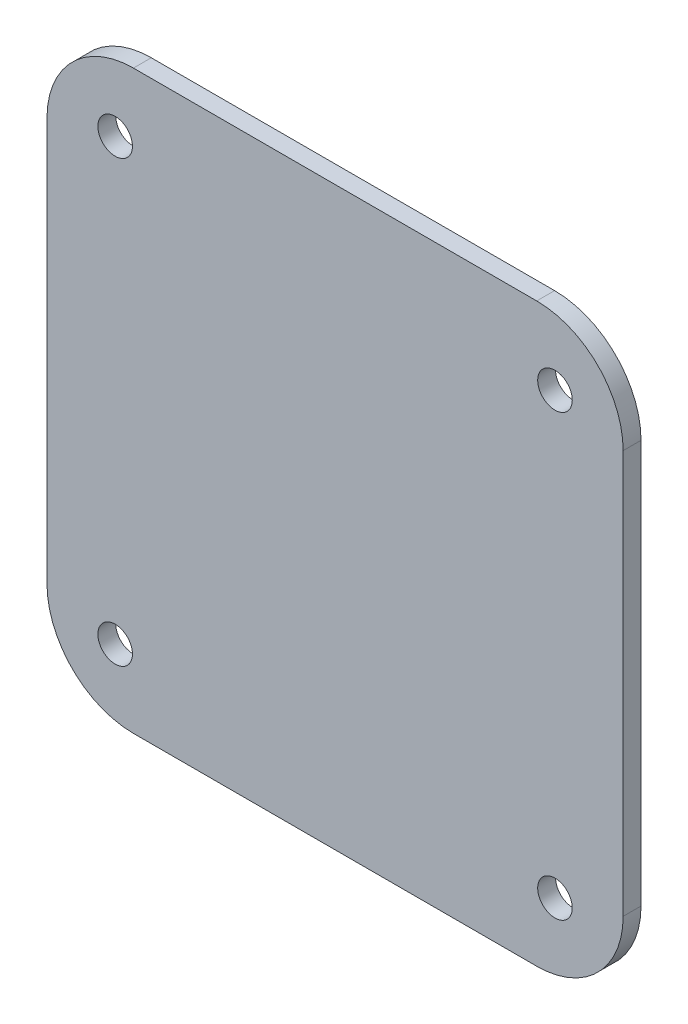
ISO-10303-21;
HEADER;
FILE_DESCRIPTION(('STEP AP214'),'2;1');
FILE_NAME('part.step','',(''),(''),'','','');
FILE_SCHEMA(('AUTOMOTIVE_DESIGN { 1 0 10303 214 1 1 1 1 }'));
ENDSEC;
DATA;
#1=APPLICATION_CONTEXT('core data for automotive mechanical design processes');
#2=APPLICATION_PROTOCOL_DEFINITION('international standard','automotive_design',2000,#1);
#3=PRODUCT_CONTEXT('',#1,'mechanical');
#4=PRODUCT('Part','Part','',(#3));
#5=PRODUCT_RELATED_PRODUCT_CATEGORY('part','',(#4));
#6=PRODUCT_DEFINITION_FORMATION('','',#4);
#7=PRODUCT_DEFINITION_CONTEXT('part definition',#1,'design');
#8=PRODUCT_DEFINITION('design','',#6,#7);
#9=PRODUCT_DEFINITION_SHAPE('','',#8);
#10=(LENGTH_UNIT() NAMED_UNIT(*) SI_UNIT(.MILLI.,.METRE.));
#11=(NAMED_UNIT(*) PLANE_ANGLE_UNIT() SI_UNIT($,.RADIAN.));
#12=(NAMED_UNIT(*) SI_UNIT($,.STERADIAN.) SOLID_ANGLE_UNIT());
#13=UNCERTAINTY_MEASURE_WITH_UNIT(LENGTH_MEASURE(1.E-05),#10,'distance_accuracy_value','');
#14=(GEOMETRIC_REPRESENTATION_CONTEXT(3) GLOBAL_UNCERTAINTY_ASSIGNED_CONTEXT((#13)) GLOBAL_UNIT_ASSIGNED_CONTEXT((#10,
#11,#12)) REPRESENTATION_CONTEXT('',''));
#15=CARTESIAN_POINT('',(0.,0.,0.));
#16=DIRECTION('',(0.,0.,1.));
#17=DIRECTION('',(1.,0.,0.));
#18=AXIS2_PLACEMENT_3D('',#15,#16,#17);
#19=CARTESIAN_POINT('',(0.,0.,3.1));
#20=DIRECTION('',(0.,0.,-1.));
#21=DIRECTION('',(-1.,0.,0.));
#22=AXIS2_PLACEMENT_3D('',#19,#20,#21);
#23=PLANE('',#22);
#24=CARTESIAN_POINT('',(38.1660885145439,-38.1660885145439,3.1));
#25=DIRECTION('',(0.,0.,1.));
#26=DIRECTION('',(1.,0.,0.));
#27=AXIS2_PLACEMENT_3D('',#24,#25,#26);
#28=CIRCLE('',#27,2.99999999999999);
#29=CARTESIAN_POINT('',(41.1660885145439,-38.1660885145439,3.1));
#30=VERTEX_POINT('',#29);
#31=EDGE_CURVE('E187',#30,#30,#28,.T.);
#32=ORIENTED_EDGE('',*,*,#31,.F.);
#33=EDGE_LOOP('',(#32));
#34=FACE_BOUND('',#33,.T.);
#35=CARTESIAN_POINT('',(-38.1660885145439,38.1660885145439,3.1));
#36=DIRECTION('',(0.,0.,1.));
#37=DIRECTION('',(1.,0.,0.));
#38=AXIS2_PLACEMENT_3D('',#35,#36,#37);
#39=CIRCLE('',#38,2.99999999999999);
#40=CARTESIAN_POINT('',(-35.1660885145439,38.1660885145439,3.1));
#41=VERTEX_POINT('',#40);
#42=EDGE_CURVE('E173',#41,#41,#39,.T.);
#43=ORIENTED_EDGE('',*,*,#42,.F.);
#44=EDGE_LOOP('',(#43));
#45=FACE_BOUND('',#44,.T.);
#46=DIRECTION('',(-1.,0.,0.));
#47=VECTOR('',#46,1.);
#48=CARTESIAN_POINT('',(-50.,50.,3.1));
#49=LINE('',#48,#47);
#50=CARTESIAN_POINT('',(35.,50.,3.1));
#51=VERTEX_POINT('',#50);
#52=CARTESIAN_POINT('',(-35.,50.,3.1));
#53=VERTEX_POINT('',#52);
#54=EDGE_CURVE('E168',#51,#53,#49,.T.);
#55=ORIENTED_EDGE('',*,*,#54,.T.);
#56=CARTESIAN_POINT('',(-35.,35.,3.1));
#57=DIRECTION('',(0.,0.,-1.));
#58=DIRECTION('',(-1.,0.,0.));
#59=AXIS2_PLACEMENT_3D('',#56,#57,#58);
#60=CIRCLE('',#59,15.);
#61=CARTESIAN_POINT('',(-50.,35.,3.1));
#62=VERTEX_POINT('',#61);
#63=EDGE_CURVE('E149',#53,#62,#60,.F.);
#64=ORIENTED_EDGE('',*,*,#63,.T.);
#65=DIRECTION('',(0.,-1.,0.));
#66=VECTOR('',#65,1.);
#67=CARTESIAN_POINT('',(-50.,-50.,3.1));
#68=LINE('',#67,#66);
#69=CARTESIAN_POINT('',(-50.,-35.,3.1));
#70=VERTEX_POINT('',#69);
#71=EDGE_CURVE('E119',#62,#70,#68,.T.);
#72=ORIENTED_EDGE('',*,*,#71,.T.);
#73=CARTESIAN_POINT('',(-35.,-35.,3.1));
#74=DIRECTION('',(0.,0.,-1.));
#75=DIRECTION('',(-1.,0.,0.));
#76=AXIS2_PLACEMENT_3D('',#73,#74,#75);
#77=CIRCLE('',#76,15.);
#78=CARTESIAN_POINT('',(-35.,-50.,3.1));
#79=VERTEX_POINT('',#78);
#80=EDGE_CURVE('E55',#70,#79,#77,.F.);
#81=ORIENTED_EDGE('',*,*,#80,.T.);
#82=DIRECTION('',(1.,0.,0.));
#83=VECTOR('',#82,1.);
#84=CARTESIAN_POINT('',(-50.,-50.,3.1));
#85=LINE('',#84,#83);
#86=CARTESIAN_POINT('',(35.,-50.,3.1));
#87=VERTEX_POINT('',#86);
#88=EDGE_CURVE('E135',#79,#87,#85,.T.);
#89=ORIENTED_EDGE('',*,*,#88,.T.);
#90=CARTESIAN_POINT('',(35.,-35.,3.1));
#91=DIRECTION('',(0.,0.,-1.));
#92=DIRECTION('',(-1.,0.,0.));
#93=AXIS2_PLACEMENT_3D('',#90,#91,#92);
#94=CIRCLE('',#93,15.);
#95=CARTESIAN_POINT('',(50.,-35.,3.1));
#96=VERTEX_POINT('',#95);
#97=EDGE_CURVE('E146',#87,#96,#94,.F.);
#98=ORIENTED_EDGE('',*,*,#97,.T.);
#99=DIRECTION('',(0.,1.,0.));
#100=VECTOR('',#99,1.);
#101=CARTESIAN_POINT('',(50.,-50.,3.1));
#102=LINE('',#101,#100);
#103=CARTESIAN_POINT('',(50.,35.,3.1));
#104=VERTEX_POINT('',#103);
#105=EDGE_CURVE('E129',#96,#104,#102,.T.);
#106=ORIENTED_EDGE('',*,*,#105,.T.);
#107=CARTESIAN_POINT('',(35.,35.,3.1));
#108=DIRECTION('',(0.,0.,-1.));
#109=DIRECTION('',(-1.,0.,0.));
#110=AXIS2_PLACEMENT_3D('',#107,#108,#109);
#111=CIRCLE('',#110,15.);
#112=EDGE_CURVE('E144',#104,#51,#111,.F.);
#113=ORIENTED_EDGE('',*,*,#112,.T.);
#114=EDGE_LOOP('',(#55,#64,#72,#81,#89,#98,#106,#113));
#115=FACE_BOUND('',#114,.T.);
#116=CARTESIAN_POINT('',(38.1660885145439,38.1660885145439,3.1));
#117=DIRECTION('',(0.,0.,1.));
#118=DIRECTION('',(1.,0.,0.));
#119=AXIS2_PLACEMENT_3D('',#116,#117,#118);
#120=CIRCLE('',#119,2.99999999999999);
#121=CARTESIAN_POINT('',(41.1660885145439,38.1660885145439,3.1));
#122=VERTEX_POINT('',#121);
#123=EDGE_CURVE('E182',#122,#122,#120,.T.);
#124=ORIENTED_EDGE('',*,*,#123,.F.);
#125=EDGE_LOOP('',(#124));
#126=FACE_BOUND('',#125,.T.);
#127=CARTESIAN_POINT('',(-38.1660885145439,-38.1660885145439,3.1));
#128=DIRECTION('',(0.,0.,1.));
#129=DIRECTION('',(1.,0.,0.));
#130=AXIS2_PLACEMENT_3D('',#127,#128,#129);
#131=CIRCLE('',#130,2.99999999999999);
#132=CARTESIAN_POINT('',(-35.1660885145439,-38.1660885145439,3.1));
#133=VERTEX_POINT('',#132);
#134=EDGE_CURVE('E193',#133,#133,#131,.T.);
#135=ORIENTED_EDGE('',*,*,#134,.F.);
#136=EDGE_LOOP('',(#135));
#137=FACE_BOUND('',#136,.T.);
#138=ADVANCED_FACE('F33',(#34,#45,#115,#126,#137),#23,.F.);
#139=CARTESIAN_POINT('',(0.,0.,0.));
#140=DIRECTION('',(0.,0.,-1.));
#141=DIRECTION('',(-1.,0.,0.));
#142=AXIS2_PLACEMENT_3D('',#139,#140,#141);
#143=PLANE('',#142);
#144=CARTESIAN_POINT('',(38.1660885145439,-38.1660885145439,0.));
#145=DIRECTION('',(0.,0.,1.));
#146=DIRECTION('',(1.,0.,0.));
#147=AXIS2_PLACEMENT_3D('',#144,#145,#146);
#148=CIRCLE('',#147,2.99999999999999);
#149=CARTESIAN_POINT('',(41.1660885145439,-38.1660885145439,0.));
#150=VERTEX_POINT('',#149);
#151=EDGE_CURVE('E190',#150,#150,#148,.T.);
#152=ORIENTED_EDGE('',*,*,#151,.T.);
#153=EDGE_LOOP('',(#152));
#154=FACE_BOUND('',#153,.T.);
#155=CARTESIAN_POINT('',(-38.1660885145439,38.1660885145439,0.));
#156=DIRECTION('',(0.,0.,1.));
#157=DIRECTION('',(1.,0.,0.));
#158=AXIS2_PLACEMENT_3D('',#155,#156,#157);
#159=CIRCLE('',#158,2.99999999999999);
#160=CARTESIAN_POINT('',(-35.1660885145439,38.1660885145439,0.));
#161=VERTEX_POINT('',#160);
#162=EDGE_CURVE('E175',#161,#161,#159,.T.);
#163=ORIENTED_EDGE('',*,*,#162,.T.);
#164=EDGE_LOOP('',(#163));
#165=FACE_BOUND('',#164,.T.);
#166=DIRECTION('',(0.,-1.,0.));
#167=VECTOR('',#166,1.);
#168=CARTESIAN_POINT('',(-50.,-50.,0.));
#169=LINE('',#168,#167);
#170=CARTESIAN_POINT('',(-50.,35.,0.));
#171=VERTEX_POINT('',#170);
#172=CARTESIAN_POINT('',(-50.,-35.,0.));
#173=VERTEX_POINT('',#172);
#174=EDGE_CURVE('E117',#171,#173,#169,.T.);
#175=ORIENTED_EDGE('',*,*,#174,.F.);
#176=CARTESIAN_POINT('',(-35.,35.,0.));
#177=DIRECTION('',(0.,0.,-1.));
#178=DIRECTION('',(-1.,0.,0.));
#179=AXIS2_PLACEMENT_3D('',#176,#177,#178);
#180=CIRCLE('',#179,15.);
#181=CARTESIAN_POINT('',(-35.,50.,0.));
#182=VERTEX_POINT('',#181);
#183=EDGE_CURVE('E100',#171,#182,#180,.T.);
#184=ORIENTED_EDGE('',*,*,#183,.T.);
#185=DIRECTION('',(-1.,0.,0.));
#186=VECTOR('',#185,1.);
#187=CARTESIAN_POINT('',(-50.,50.,0.));
#188=LINE('',#187,#186);
#189=CARTESIAN_POINT('',(35.,50.,0.));
#190=VERTEX_POINT('',#189);
#191=EDGE_CURVE('E127',#190,#182,#188,.T.);
#192=ORIENTED_EDGE('',*,*,#191,.F.);
#193=CARTESIAN_POINT('',(35.,35.,0.));
#194=DIRECTION('',(0.,0.,-1.));
#195=DIRECTION('',(-1.,0.,0.));
#196=AXIS2_PLACEMENT_3D('',#193,#194,#195);
#197=CIRCLE('',#196,15.);
#198=CARTESIAN_POINT('',(50.,35.,0.));
#199=VERTEX_POINT('',#198);
#200=EDGE_CURVE('E120',#190,#199,#197,.T.);
#201=ORIENTED_EDGE('',*,*,#200,.T.);
#202=DIRECTION('',(0.,1.,0.));
#203=VECTOR('',#202,1.);
#204=CARTESIAN_POINT('',(50.,-50.,0.));
#205=LINE('',#204,#203);
#206=CARTESIAN_POINT('',(50.,-35.,0.));
#207=VERTEX_POINT('',#206);
#208=EDGE_CURVE('E131',#207,#199,#205,.T.);
#209=ORIENTED_EDGE('',*,*,#208,.F.);
#210=CARTESIAN_POINT('',(35.,-35.,0.));
#211=DIRECTION('',(0.,0.,-1.));
#212=DIRECTION('',(-1.,0.,0.));
#213=AXIS2_PLACEMENT_3D('',#210,#211,#212);
#214=CIRCLE('',#213,15.);
#215=CARTESIAN_POINT('',(35.,-50.,0.));
#216=VERTEX_POINT('',#215);
#217=EDGE_CURVE('E138',#207,#216,#214,.T.);
#218=ORIENTED_EDGE('',*,*,#217,.T.);
#219=DIRECTION('',(1.,0.,0.));
#220=VECTOR('',#219,1.);
#221=CARTESIAN_POINT('',(-50.,-50.,0.));
#222=LINE('',#221,#220);
#223=CARTESIAN_POINT('',(-35.,-50.,0.));
#224=VERTEX_POINT('',#223);
#225=EDGE_CURVE('E126',#224,#216,#222,.T.);
#226=ORIENTED_EDGE('',*,*,#225,.F.);
#227=CARTESIAN_POINT('',(-35.,-35.,0.));
#228=DIRECTION('',(0.,0.,-1.));
#229=DIRECTION('',(-1.,0.,0.));
#230=AXIS2_PLACEMENT_3D('',#227,#228,#229);
#231=CIRCLE('',#230,15.);
#232=EDGE_CURVE('E111',#224,#173,#231,.T.);
#233=ORIENTED_EDGE('',*,*,#232,.T.);
#234=EDGE_LOOP('',(#175,#184,#192,#201,#209,#218,#226,#233));
#235=FACE_BOUND('',#234,.T.);
#236=CARTESIAN_POINT('',(38.1660885145439,38.1660885145439,0.));
#237=DIRECTION('',(0.,0.,1.));
#238=DIRECTION('',(1.,0.,0.));
#239=AXIS2_PLACEMENT_3D('',#236,#237,#238);
#240=CIRCLE('',#239,2.99999999999999);
#241=CARTESIAN_POINT('',(41.1660885145439,38.1660885145439,0.));
#242=VERTEX_POINT('',#241);
#243=EDGE_CURVE('E184',#242,#242,#240,.T.);
#244=ORIENTED_EDGE('',*,*,#243,.T.);
#245=EDGE_LOOP('',(#244));
#246=FACE_BOUND('',#245,.T.);
#247=CARTESIAN_POINT('',(-38.1660885145439,-38.1660885145439,0.));
#248=DIRECTION('',(0.,0.,1.));
#249=DIRECTION('',(1.,0.,0.));
#250=AXIS2_PLACEMENT_3D('',#247,#248,#249);
#251=CIRCLE('',#250,2.99999999999999);
#252=CARTESIAN_POINT('',(-35.1660885145439,-38.1660885145439,0.));
#253=VERTEX_POINT('',#252);
#254=EDGE_CURVE('E196',#253,#253,#251,.T.);
#255=ORIENTED_EDGE('',*,*,#254,.T.);
#256=EDGE_LOOP('',(#255));
#257=FACE_BOUND('',#256,.T.);
#258=ADVANCED_FACE('F123',(#154,#165,#235,#246,#257),#143,.T.);
#259=CARTESIAN_POINT('',(50.,-50.,3.1));
#260=DIRECTION('',(-1.,0.,0.));
#261=DIRECTION('',(0.,0.,1.));
#262=AXIS2_PLACEMENT_3D('',#259,#260,#261);
#263=PLANE('',#262);
#264=ORIENTED_EDGE('',*,*,#105,.F.);
#265=DIRECTION('',(0.,0.,-1.));
#266=VECTOR('',#265,1.);
#267=CARTESIAN_POINT('',(50.,-35.,3.1));
#268=LINE('',#267,#266);
#269=EDGE_CURVE('E11',#96,#207,#268,.T.);
#270=ORIENTED_EDGE('',*,*,#269,.T.);
#271=ORIENTED_EDGE('',*,*,#208,.T.);
#272=DIRECTION('',(0.,0.,-1.));
#273=VECTOR('',#272,1.);
#274=CARTESIAN_POINT('',(50.,35.,3.1));
#275=LINE('',#274,#273);
#276=EDGE_CURVE('E41',#199,#104,#275,.F.);
#277=ORIENTED_EDGE('',*,*,#276,.T.);
#278=EDGE_LOOP('',(#264,#270,#271,#277));
#279=FACE_BOUND('',#278,.T.);
#280=ADVANCED_FACE('F159',(#279),#263,.F.);
#281=CARTESIAN_POINT('',(-50.,50.,3.1));
#282=DIRECTION('',(0.,-1.,0.));
#283=DIRECTION('',(0.,0.,-1.));
#284=AXIS2_PLACEMENT_3D('',#281,#282,#283);
#285=PLANE('',#284);
#286=ORIENTED_EDGE('',*,*,#191,.T.);
#287=DIRECTION('',(0.,0.,-1.));
#288=VECTOR('',#287,1.);
#289=CARTESIAN_POINT('',(-35.,50.,3.1));
#290=LINE('',#289,#288);
#291=EDGE_CURVE('E105',#182,#53,#290,.F.);
#292=ORIENTED_EDGE('',*,*,#291,.T.);
#293=ORIENTED_EDGE('',*,*,#54,.F.);
#294=DIRECTION('',(0.,0.,-1.));
#295=VECTOR('',#294,1.);
#296=CARTESIAN_POINT('',(35.,50.,3.1));
#297=LINE('',#296,#295);
#298=EDGE_CURVE('E110',#51,#190,#297,.T.);
#299=ORIENTED_EDGE('',*,*,#298,.T.);
#300=EDGE_LOOP('',(#286,#292,#293,#299));
#301=FACE_BOUND('',#300,.T.);
#302=ADVANCED_FACE('F172',(#301),#285,.F.);
#303=CARTESIAN_POINT('',(-50.,-50.,3.1));
#304=DIRECTION('',(1.,0.,0.));
#305=DIRECTION('',(0.,0.,-1.));
#306=AXIS2_PLACEMENT_3D('',#303,#304,#305);
#307=PLANE('',#306);
#308=ORIENTED_EDGE('',*,*,#71,.F.);
#309=DIRECTION('',(0.,0.,-1.));
#310=VECTOR('',#309,1.);
#311=CARTESIAN_POINT('',(-50.,35.,3.1));
#312=LINE('',#311,#310);
#313=EDGE_CURVE('E104',#62,#171,#312,.T.);
#314=ORIENTED_EDGE('',*,*,#313,.T.);
#315=ORIENTED_EDGE('',*,*,#174,.T.);
#316=DIRECTION('',(0.,0.,-1.));
#317=VECTOR('',#316,1.);
#318=CARTESIAN_POINT('',(-50.,-35.,3.1));
#319=LINE('',#318,#317);
#320=EDGE_CURVE('E121',#173,#70,#319,.F.);
#321=ORIENTED_EDGE('',*,*,#320,.T.);
#322=EDGE_LOOP('',(#308,#314,#315,#321));
#323=FACE_BOUND('',#322,.T.);
#324=ADVANCED_FACE('F116',(#323),#307,.F.);
#325=CARTESIAN_POINT('',(-50.,-50.,3.1));
#326=DIRECTION('',(0.,1.,0.));
#327=DIRECTION('',(-1.,0.,0.));
#328=AXIS2_PLACEMENT_3D('',#325,#326,#327);
#329=PLANE('',#328);
#330=ORIENTED_EDGE('',*,*,#88,.F.);
#331=DIRECTION('',(0.,0.,-1.));
#332=VECTOR('',#331,1.);
#333=CARTESIAN_POINT('',(-35.,-50.,3.1));
#334=LINE('',#333,#332);
#335=EDGE_CURVE('E152',#79,#224,#334,.T.);
#336=ORIENTED_EDGE('',*,*,#335,.T.);
#337=ORIENTED_EDGE('',*,*,#225,.T.);
#338=DIRECTION('',(0.,0.,-1.));
#339=VECTOR('',#338,1.);
#340=CARTESIAN_POINT('',(35.,-50.,3.1));
#341=LINE('',#340,#339);
#342=EDGE_CURVE('E48',#216,#87,#341,.F.);
#343=ORIENTED_EDGE('',*,*,#342,.T.);
#344=EDGE_LOOP('',(#330,#336,#337,#343));
#345=FACE_BOUND('',#344,.T.);
#346=ADVANCED_FACE('F219',(#345),#329,.F.);
#347=CARTESIAN_POINT('',(-38.1660885145439,38.1660885145439,3.1));
#348=DIRECTION('',(0.,0.,-1.));
#349=DIRECTION('',(-1.,0.,0.));
#350=AXIS2_PLACEMENT_3D('',#347,#348,#349);
#351=CYLINDRICAL_SURFACE('',#350,2.99999999999999);
#352=ORIENTED_EDGE('',*,*,#42,.T.);
#353=EDGE_LOOP('',(#352));
#354=FACE_BOUND('',#353,.T.);
#355=ORIENTED_EDGE('',*,*,#162,.F.);
#356=EDGE_LOOP('',(#355));
#357=FACE_BOUND('',#356,.T.);
#358=ADVANCED_FACE('F216',(#354,#357),#351,.F.);
#359=CARTESIAN_POINT('',(38.1660885145439,38.1660885145439,3.1));
#360=DIRECTION('',(0.,0.,-1.));
#361=DIRECTION('',(-1.,0.,0.));
#362=AXIS2_PLACEMENT_3D('',#359,#360,#361);
#363=CYLINDRICAL_SURFACE('',#362,2.99999999999999);
#364=ORIENTED_EDGE('',*,*,#123,.T.);
#365=EDGE_LOOP('',(#364));
#366=FACE_BOUND('',#365,.T.);
#367=ORIENTED_EDGE('',*,*,#243,.F.);
#368=EDGE_LOOP('',(#367));
#369=FACE_BOUND('',#368,.T.);
#370=ADVANCED_FACE('F311',(#366,#369),#363,.F.);
#371=CARTESIAN_POINT('',(38.1660885145439,-38.1660885145439,3.1));
#372=DIRECTION('',(0.,0.,-1.));
#373=DIRECTION('',(-1.,0.,0.));
#374=AXIS2_PLACEMENT_3D('',#371,#372,#373);
#375=CYLINDRICAL_SURFACE('',#374,2.99999999999999);
#376=ORIENTED_EDGE('',*,*,#31,.T.);
#377=EDGE_LOOP('',(#376));
#378=FACE_BOUND('',#377,.T.);
#379=ORIENTED_EDGE('',*,*,#151,.F.);
#380=EDGE_LOOP('',(#379));
#381=FACE_BOUND('',#380,.T.);
#382=ADVANCED_FACE('F302',(#378,#381),#375,.F.);
#383=CARTESIAN_POINT('',(-38.1660885145439,-38.1660885145439,3.1));
#384=DIRECTION('',(0.,0.,-1.));
#385=DIRECTION('',(-1.,0.,0.));
#386=AXIS2_PLACEMENT_3D('',#383,#384,#385);
#387=CYLINDRICAL_SURFACE('',#386,2.99999999999999);
#388=ORIENTED_EDGE('',*,*,#134,.T.);
#389=EDGE_LOOP('',(#388));
#390=FACE_BOUND('',#389,.T.);
#391=ORIENTED_EDGE('',*,*,#254,.F.);
#392=EDGE_LOOP('',(#391));
#393=FACE_BOUND('',#392,.T.);
#394=ADVANCED_FACE('F202',(#390,#393),#387,.F.);
#395=CARTESIAN_POINT('',(-35.,35.,3.1));
#396=DIRECTION('',(0.,0.,-1.));
#397=DIRECTION('',(-1.,0.,0.));
#398=AXIS2_PLACEMENT_3D('',#395,#396,#397);
#399=CYLINDRICAL_SURFACE('',#398,15.);
#400=ORIENTED_EDGE('',*,*,#63,.F.);
#401=ORIENTED_EDGE('',*,*,#291,.F.);
#402=ORIENTED_EDGE('',*,*,#183,.F.);
#403=ORIENTED_EDGE('',*,*,#313,.F.);
#404=EDGE_LOOP('',(#400,#401,#402,#403));
#405=FACE_BOUND('',#404,.T.);
#406=ADVANCED_FACE('F103',(#405),#399,.T.);
#407=CARTESIAN_POINT('',(-35.,-35.,3.1));
#408=DIRECTION('',(0.,0.,-1.));
#409=DIRECTION('',(-1.,0.,0.));
#410=AXIS2_PLACEMENT_3D('',#407,#408,#409);
#411=CYLINDRICAL_SURFACE('',#410,15.);
#412=ORIENTED_EDGE('',*,*,#80,.F.);
#413=ORIENTED_EDGE('',*,*,#320,.F.);
#414=ORIENTED_EDGE('',*,*,#232,.F.);
#415=ORIENTED_EDGE('',*,*,#335,.F.);
#416=EDGE_LOOP('',(#412,#413,#414,#415));
#417=FACE_BOUND('',#416,.T.);
#418=ADVANCED_FACE('F230',(#417),#411,.T.);
#419=CARTESIAN_POINT('',(35.,-35.,3.1));
#420=DIRECTION('',(0.,0.,-1.));
#421=DIRECTION('',(-1.,0.,0.));
#422=AXIS2_PLACEMENT_3D('',#419,#420,#421);
#423=CYLINDRICAL_SURFACE('',#422,15.);
#424=ORIENTED_EDGE('',*,*,#97,.F.);
#425=ORIENTED_EDGE('',*,*,#342,.F.);
#426=ORIENTED_EDGE('',*,*,#217,.F.);
#427=ORIENTED_EDGE('',*,*,#269,.F.);
#428=EDGE_LOOP('',(#424,#425,#426,#427));
#429=FACE_BOUND('',#428,.T.);
#430=ADVANCED_FACE('F232',(#429),#423,.T.);
#431=CARTESIAN_POINT('',(35.,35.,3.1));
#432=DIRECTION('',(0.,0.,-1.));
#433=DIRECTION('',(-1.,0.,0.));
#434=AXIS2_PLACEMENT_3D('',#431,#432,#433);
#435=CYLINDRICAL_SURFACE('',#434,15.);
#436=ORIENTED_EDGE('',*,*,#112,.F.);
#437=ORIENTED_EDGE('',*,*,#276,.F.);
#438=ORIENTED_EDGE('',*,*,#200,.F.);
#439=ORIENTED_EDGE('',*,*,#298,.F.);
#440=EDGE_LOOP('',(#436,#437,#438,#439));
#441=FACE_BOUND('',#440,.T.);
#442=ADVANCED_FACE('F35',(#441),#435,.T.);
#443=CLOSED_SHELL('',(#138,#258,#280,#302,#324,#346,#358,#370,#382,#394,#406,#418,#430,#442));
#444=MANIFOLD_SOLID_BREP('B2',#443);
#445=ADVANCED_BREP_SHAPE_REPRESENTATION('',(#18,#444),#14);
#446=SHAPE_DEFINITION_REPRESENTATION(#9,#445);
ENDSEC;
END-ISO-10303-21;
